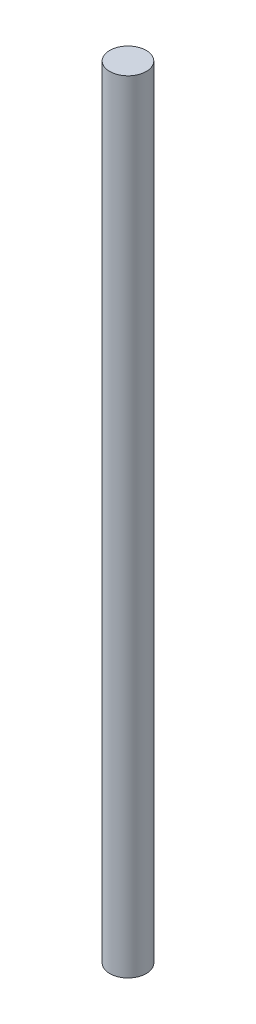
ISO-10303-21;
HEADER;
FILE_DESCRIPTION(('STEP AP214'),'2;1');
FILE_NAME('part.step','',(''),(''),'','','');
FILE_SCHEMA(('AUTOMOTIVE_DESIGN { 1 0 10303 214 1 1 1 1 }'));
ENDSEC;
DATA;
#1=APPLICATION_CONTEXT('core data for automotive mechanical design processes');
#2=APPLICATION_PROTOCOL_DEFINITION('international standard','automotive_design',2000,#1);
#3=PRODUCT_CONTEXT('',#1,'mechanical');
#4=PRODUCT('Part','Part','',(#3));
#5=PRODUCT_RELATED_PRODUCT_CATEGORY('part','',(#4));
#6=PRODUCT_DEFINITION_FORMATION('','',#4);
#7=PRODUCT_DEFINITION_CONTEXT('part definition',#1,'design');
#8=PRODUCT_DEFINITION('design','',#6,#7);
#9=PRODUCT_DEFINITION_SHAPE('','',#8);
#10=(LENGTH_UNIT() NAMED_UNIT(*) SI_UNIT(.MILLI.,.METRE.));
#11=(NAMED_UNIT(*) PLANE_ANGLE_UNIT() SI_UNIT($,.RADIAN.));
#12=(NAMED_UNIT(*) SI_UNIT($,.STERADIAN.) SOLID_ANGLE_UNIT());
#13=UNCERTAINTY_MEASURE_WITH_UNIT(LENGTH_MEASURE(1.E-05),#10,'distance_accuracy_value','');
#14=(GEOMETRIC_REPRESENTATION_CONTEXT(3) GLOBAL_UNCERTAINTY_ASSIGNED_CONTEXT((#13)) GLOBAL_UNIT_ASSIGNED_CONTEXT((#10,
#11,#12)) REPRESENTATION_CONTEXT('',''));
#15=CARTESIAN_POINT('',(0.,0.,0.));
#16=DIRECTION('',(0.,0.,1.));
#17=DIRECTION('',(1.,0.,0.));
#18=AXIS2_PLACEMENT_3D('',#15,#16,#17);
#19=CARTESIAN_POINT('',(0.,39116.,0.));
#20=DIRECTION('',(0.,-1.,0.));
#21=DIRECTION('',(0.,0.,-1.));
#22=AXIS2_PLACEMENT_3D('',#19,#20,#21);
#23=CYLINDRICAL_SURFACE('',#22,914.4);
#24=CARTESIAN_POINT('',(0.,39116.,0.));
#25=DIRECTION('',(0.,1.,0.));
#26=DIRECTION('',(0.,0.,1.));
#27=AXIS2_PLACEMENT_3D('',#24,#25,#26);
#28=CIRCLE('',#27,914.4);
#29=CARTESIAN_POINT('',(0.,39116.,914.4));
#30=VERTEX_POINT('',#29);
#31=EDGE_CURVE('E10',#30,#30,#28,.T.);
#32=ORIENTED_EDGE('',*,*,#31,.F.);
#33=EDGE_LOOP('',(#32));
#34=FACE_BOUND('',#33,.T.);
#35=CARTESIAN_POINT('',(0.,0.,0.));
#36=DIRECTION('',(0.,1.,0.));
#37=DIRECTION('',(0.,0.,1.));
#38=AXIS2_PLACEMENT_3D('',#35,#36,#37);
#39=CIRCLE('',#38,914.4);
#40=CARTESIAN_POINT('',(0.,0.,914.4));
#41=VERTEX_POINT('',#40);
#42=EDGE_CURVE('E40',#41,#41,#39,.T.);
#43=ORIENTED_EDGE('',*,*,#42,.T.);
#44=EDGE_LOOP('',(#43));
#45=FACE_BOUND('',#44,.T.);
#46=ADVANCED_FACE('F37',(#34,#45),#23,.T.);
#47=CARTESIAN_POINT('',(0.,39116.,0.));
#48=DIRECTION('',(0.,1.,0.));
#49=DIRECTION('',(0.,0.,1.));
#50=AXIS2_PLACEMENT_3D('',#47,#48,#49);
#51=PLANE('',#50);
#52=ORIENTED_EDGE('',*,*,#31,.T.);
#53=EDGE_LOOP('',(#52));
#54=FACE_BOUND('',#53,.T.);
#55=ADVANCED_FACE('F54',(#54),#51,.T.);
#56=CARTESIAN_POINT('',(0.,0.,0.));
#57=DIRECTION('',(0.,1.,0.));
#58=DIRECTION('',(0.,0.,1.));
#59=AXIS2_PLACEMENT_3D('',#56,#57,#58);
#60=PLANE('',#59);
#61=ORIENTED_EDGE('',*,*,#42,.F.);
#62=EDGE_LOOP('',(#61));
#63=FACE_BOUND('',#62,.T.);
#64=ADVANCED_FACE('F52',(#63),#60,.F.);
#65=CLOSED_SHELL('',(#46,#55,#64));
#66=MANIFOLD_SOLID_BREP('B2',#65);
#67=ADVANCED_BREP_SHAPE_REPRESENTATION('',(#18,#66),#14);
#68=SHAPE_DEFINITION_REPRESENTATION(#9,#67);
ENDSEC;
END-ISO-10303-21;
